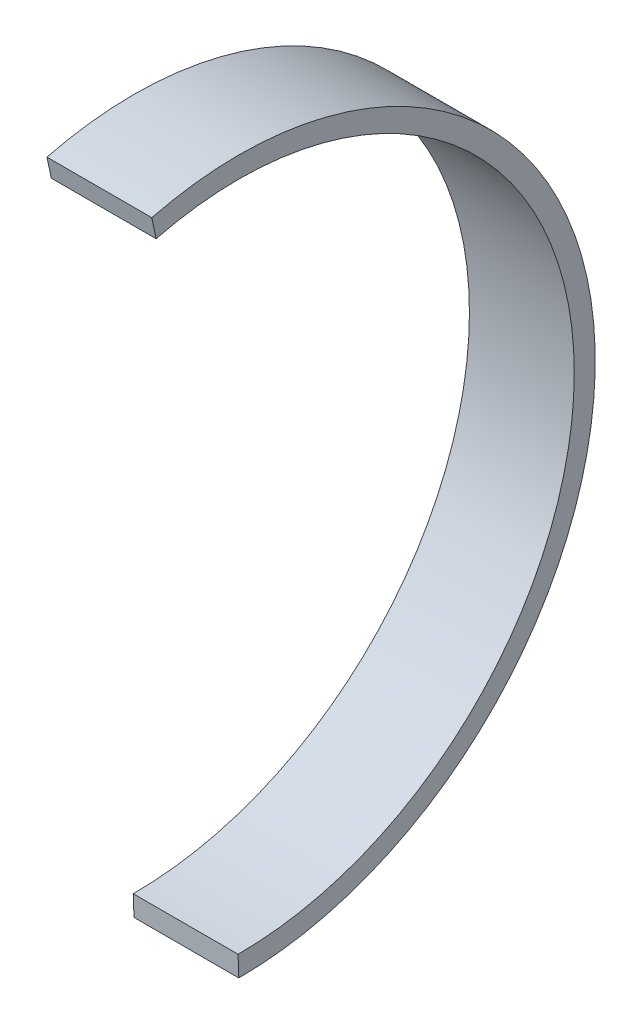
ISO-10303-21;
HEADER;
FILE_DESCRIPTION(('STEP AP214'),'2;1');
FILE_NAME('part.step','',(''),(''),'','','');
FILE_SCHEMA(('AUTOMOTIVE_DESIGN { 1 0 10303 214 1 1 1 1 }'));
ENDSEC;
DATA;
#1=APPLICATION_CONTEXT('core data for automotive mechanical design processes');
#2=APPLICATION_PROTOCOL_DEFINITION('international standard','automotive_design',2000,#1);
#3=PRODUCT_CONTEXT('',#1,'mechanical');
#4=PRODUCT('Part','Part','',(#3));
#5=PRODUCT_RELATED_PRODUCT_CATEGORY('part','',(#4));
#6=PRODUCT_DEFINITION_FORMATION('','',#4);
#7=PRODUCT_DEFINITION_CONTEXT('part definition',#1,'design');
#8=PRODUCT_DEFINITION('design','',#6,#7);
#9=PRODUCT_DEFINITION_SHAPE('','',#8);
#10=(LENGTH_UNIT() NAMED_UNIT(*) SI_UNIT(.MILLI.,.METRE.));
#11=(NAMED_UNIT(*) PLANE_ANGLE_UNIT() SI_UNIT($,.RADIAN.));
#12=(NAMED_UNIT(*) SI_UNIT($,.STERADIAN.) SOLID_ANGLE_UNIT());
#13=UNCERTAINTY_MEASURE_WITH_UNIT(LENGTH_MEASURE(1.E-05),#10,'distance_accuracy_value','');
#14=(GEOMETRIC_REPRESENTATION_CONTEXT(3) GLOBAL_UNCERTAINTY_ASSIGNED_CONTEXT((#13)) GLOBAL_UNIT_ASSIGNED_CONTEXT((#10,
#11,#12)) REPRESENTATION_CONTEXT('',''));
#15=CARTESIAN_POINT('',(0.,0.,0.));
#16=DIRECTION('',(0.,0.,1.));
#17=DIRECTION('',(1.,0.,0.));
#18=AXIS2_PLACEMENT_3D('',#15,#16,#17);
#19=CARTESIAN_POINT('',(25.,0.,-3.10402494457253));
#20=DIRECTION('',(-1.,0.,0.));
#21=DIRECTION('',(0.,0.,1.));
#22=AXIS2_PLACEMENT_3D('',#19,#20,#21);
#23=CYLINDRICAL_SURFACE('',#22,80.);
#24=CARTESIAN_POINT('',(0.,0.,-3.10402494457253));
#25=DIRECTION('',(1.,0.,0.));
#26=DIRECTION('',(0.,0.,-1.));
#27=AXIS2_PLACEMENT_3D('',#24,#25,#26);
#28=CIRCLE('',#27,80.);
#29=CARTESIAN_POINT('',(0.,-79.9997916136129,-2.92142763210893));
#30=VERTEX_POINT('',#29);
#31=CARTESIAN_POINT('',(0.,77.5330771315045,16.6094717143203));
#32=VERTEX_POINT('',#31);
#33=EDGE_CURVE('E98',#30,#32,#28,.T.);
#34=ORIENTED_EDGE('',*,*,#33,.F.);
#35=DIRECTION('',(-1.,0.,0.));
#36=VECTOR('',#35,1.);
#37=CARTESIAN_POINT('',(25.,-79.9997916136129,-2.92142763210893));
#38=LINE('',#37,#36);
#39=CARTESIAN_POINT('',(25.,-79.9997916136129,-2.92142763210893));
#40=VERTEX_POINT('',#39);
#41=EDGE_CURVE('E11',#40,#30,#38,.T.);
#42=ORIENTED_EDGE('',*,*,#41,.F.);
#43=CARTESIAN_POINT('',(25.,0.,-3.10402494457253));
#44=DIRECTION('',(1.,0.,0.));
#45=DIRECTION('',(0.,0.,-1.));
#46=AXIS2_PLACEMENT_3D('',#43,#44,#45);
#47=CIRCLE('',#46,80.);
#48=CARTESIAN_POINT('',(25.,77.5330771315045,16.6094717143203));
#49=VERTEX_POINT('',#48);
#50=EDGE_CURVE('E83',#40,#49,#47,.T.);
#51=ORIENTED_EDGE('',*,*,#50,.T.);
#52=DIRECTION('',(-1.,0.,0.));
#53=VECTOR('',#52,1.);
#54=CARTESIAN_POINT('',(25.,77.5330771315045,16.6094717143203));
#55=LINE('',#54,#53);
#56=EDGE_CURVE('E51',#49,#32,#55,.T.);
#57=ORIENTED_EDGE('',*,*,#56,.T.);
#58=EDGE_LOOP('',(#34,#42,#51,#57));
#59=FACE_BOUND('',#58,.T.);
#60=ADVANCED_FACE('F35',(#59),#23,.F.);
#61=CARTESIAN_POINT('',(25.,0.,0.));
#62=DIRECTION('',(0.,0.036493615418901,-0.999333886163007));
#63=DIRECTION('',(0.,0.999333886163007,0.036493615418901));
#64=AXIS2_PLACEMENT_3D('',#61,#62,#63);
#65=PLANE('',#64);
#66=DIRECTION('',(0.,-0.999333886163007,-0.036493615418901));
#67=VECTOR('',#66,1.);
#68=CARTESIAN_POINT('',(0.,0.,0.));
#69=LINE('',#68,#67);
#70=CARTESIAN_POINT('',(0.,-85.,-3.10402494457253));
#71=VERTEX_POINT('',#70);
#72=EDGE_CURVE('E89',#30,#71,#69,.T.);
#73=ORIENTED_EDGE('',*,*,#72,.T.);
#74=DIRECTION('',(-1.,0.,0.));
#75=VECTOR('',#74,1.);
#76=CARTESIAN_POINT('',(25.,-85.,-3.10402494457253));
#77=LINE('',#76,#75);
#78=CARTESIAN_POINT('',(25.,-85.,-3.10402494457253));
#79=VERTEX_POINT('',#78);
#80=EDGE_CURVE('E43',#79,#71,#77,.T.);
#81=ORIENTED_EDGE('',*,*,#80,.F.);
#82=DIRECTION('',(0.,-0.999333886163007,-0.036493615418901));
#83=VECTOR('',#82,1.);
#84=CARTESIAN_POINT('',(25.,0.,0.));
#85=LINE('',#84,#83);
#86=EDGE_CURVE('E77',#40,#79,#85,.T.);
#87=ORIENTED_EDGE('',*,*,#86,.F.);
#88=ORIENTED_EDGE('',*,*,#41,.T.);
#89=EDGE_LOOP('',(#73,#81,#87,#88));
#90=FACE_BOUND('',#89,.T.);
#91=ADVANCED_FACE('F87',(#90),#65,.F.);
#92=CARTESIAN_POINT('',(25.,0.,-3.10402494457253));
#93=DIRECTION('',(-1.,0.,0.));
#94=DIRECTION('',(0.,0.,1.));
#95=AXIS2_PLACEMENT_3D('',#92,#93,#94);
#96=CYLINDRICAL_SURFACE('',#95,85.);
#97=CARTESIAN_POINT('',(0.,0.,-3.10402494457253));
#98=DIRECTION('',(1.,0.,0.));
#99=DIRECTION('',(0.,0.,-1.));
#100=AXIS2_PLACEMENT_3D('',#97,#98,#99);
#101=CIRCLE('',#100,85.);
#102=CARTESIAN_POINT('',(0.,82.425465751553,17.6575404019894));
#103=VERTEX_POINT('',#102);
#104=EDGE_CURVE('E101',#71,#103,#101,.T.);
#105=ORIENTED_EDGE('',*,*,#104,.T.);
#106=DIRECTION('',(-1.,0.,0.));
#107=VECTOR('',#106,1.);
#108=CARTESIAN_POINT('',(25.,82.425465751553,17.6575404019894));
#109=LINE('',#108,#107);
#110=CARTESIAN_POINT('',(25.,82.425465751553,17.6575404019894));
#111=VERTEX_POINT('',#110);
#112=EDGE_CURVE('E65',#111,#103,#109,.T.);
#113=ORIENTED_EDGE('',*,*,#112,.F.);
#114=CARTESIAN_POINT('',(25.,0.,-3.10402494457253));
#115=DIRECTION('',(1.,0.,0.));
#116=DIRECTION('',(0.,0.,-1.));
#117=AXIS2_PLACEMENT_3D('',#114,#115,#116);
#118=CIRCLE('',#117,85.);
#119=EDGE_CURVE('E82',#79,#111,#118,.T.);
#120=ORIENTED_EDGE('',*,*,#119,.F.);
#121=ORIENTED_EDGE('',*,*,#80,.T.);
#122=EDGE_LOOP('',(#105,#113,#120,#121));
#123=FACE_BOUND('',#122,.T.);
#124=ADVANCED_FACE('F92',(#123),#96,.T.);
#125=CARTESIAN_POINT('',(25.,0.,0.));
#126=DIRECTION('',(0.,-0.209471703612998,0.977814709127178));
#127=DIRECTION('',(0.,-0.977814709127178,-0.209471703612998));
#128=AXIS2_PLACEMENT_3D('',#125,#126,#127);
#129=PLANE('',#128);
#130=DIRECTION('',(0.,0.977814709127178,0.209471703612998));
#131=VECTOR('',#130,1.);
#132=CARTESIAN_POINT('',(0.,0.,0.));
#133=LINE('',#132,#131);
#134=EDGE_CURVE('E103',#32,#103,#133,.T.);
#135=ORIENTED_EDGE('',*,*,#134,.F.);
#136=ORIENTED_EDGE('',*,*,#56,.F.);
#137=DIRECTION('',(0.,0.977814709127178,0.209471703612998));
#138=VECTOR('',#137,1.);
#139=CARTESIAN_POINT('',(25.,0.,0.));
#140=LINE('',#139,#138);
#141=EDGE_CURVE('E93',#49,#111,#140,.T.);
#142=ORIENTED_EDGE('',*,*,#141,.T.);
#143=ORIENTED_EDGE('',*,*,#112,.T.);
#144=EDGE_LOOP('',(#135,#136,#142,#143));
#145=FACE_BOUND('',#144,.T.);
#146=ADVANCED_FACE('F108',(#145),#129,.T.);
#147=CARTESIAN_POINT('',(25.,0.,0.));
#148=DIRECTION('',(1.,0.,0.));
#149=DIRECTION('',(0.,0.,-1.));
#150=AXIS2_PLACEMENT_3D('',#147,#148,#149);
#151=PLANE('',#150);
#152=ORIENTED_EDGE('',*,*,#50,.F.);
#153=ORIENTED_EDGE('',*,*,#86,.T.);
#154=ORIENTED_EDGE('',*,*,#119,.T.);
#155=ORIENTED_EDGE('',*,*,#141,.F.);
#156=EDGE_LOOP('',(#152,#153,#154,#155));
#157=FACE_BOUND('',#156,.T.);
#158=ADVANCED_FACE('F79',(#157),#151,.T.);
#159=CARTESIAN_POINT('',(0.,0.,0.));
#160=DIRECTION('',(1.,0.,0.));
#161=DIRECTION('',(0.,0.,-1.));
#162=AXIS2_PLACEMENT_3D('',#159,#160,#161);
#163=PLANE('',#162);
#164=ORIENTED_EDGE('',*,*,#33,.T.);
#165=ORIENTED_EDGE('',*,*,#134,.T.);
#166=ORIENTED_EDGE('',*,*,#104,.F.);
#167=ORIENTED_EDGE('',*,*,#72,.F.);
#168=EDGE_LOOP('',(#164,#165,#166,#167));
#169=FACE_BOUND('',#168,.T.);
#170=ADVANCED_FACE('F115',(#169),#163,.F.);
#171=CLOSED_SHELL('',(#60,#91,#124,#146,#158,#170));
#172=MANIFOLD_SOLID_BREP('B2',#171);
#173=ADVANCED_BREP_SHAPE_REPRESENTATION('',(#18,#172),#14);
#174=SHAPE_DEFINITION_REPRESENTATION(#9,#173);
ENDSEC;
END-ISO-10303-21;
